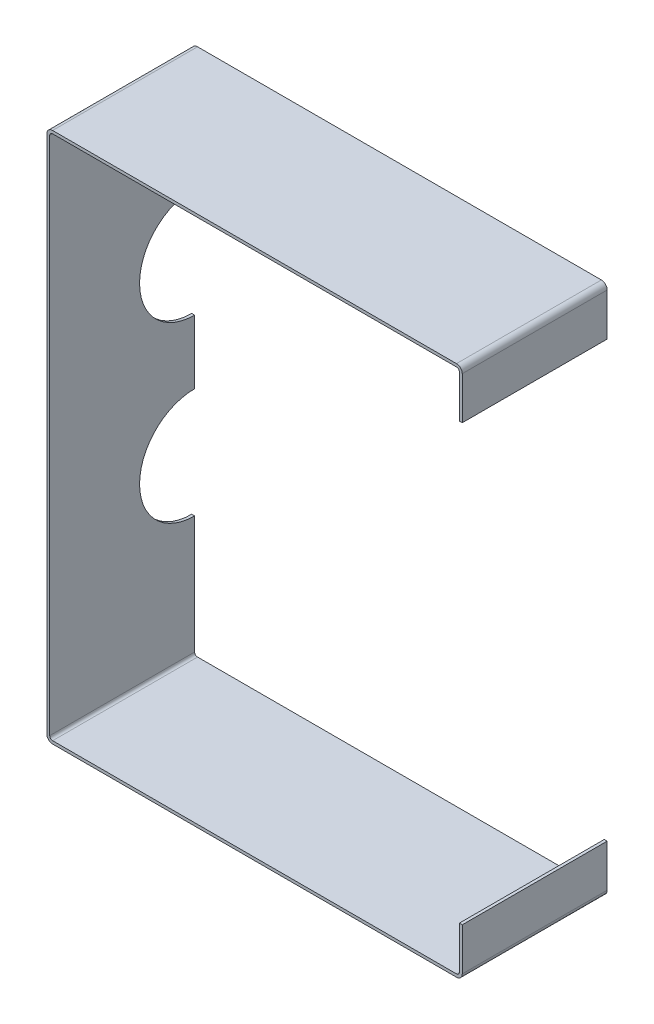
ISO-10303-21;
HEADER;
FILE_DESCRIPTION(('STEP AP214'),'2;1');
FILE_NAME('part.step','',(''),(''),'','','');
FILE_SCHEMA(('AUTOMOTIVE_DESIGN { 1 0 10303 214 1 1 1 1 }'));
ENDSEC;
DATA;
#1=APPLICATION_CONTEXT('core data for automotive mechanical design processes');
#2=APPLICATION_PROTOCOL_DEFINITION('international standard','automotive_design',2000,#1);
#3=PRODUCT_CONTEXT('',#1,'mechanical');
#4=PRODUCT('Part','Part','',(#3));
#5=PRODUCT_RELATED_PRODUCT_CATEGORY('part','',(#4));
#6=PRODUCT_DEFINITION_FORMATION('','',#4);
#7=PRODUCT_DEFINITION_CONTEXT('part definition',#1,'design');
#8=PRODUCT_DEFINITION('design','',#6,#7);
#9=PRODUCT_DEFINITION_SHAPE('','',#8);
#10=(LENGTH_UNIT() NAMED_UNIT(*) SI_UNIT(.MILLI.,.METRE.));
#11=(NAMED_UNIT(*) PLANE_ANGLE_UNIT() SI_UNIT($,.RADIAN.));
#12=(NAMED_UNIT(*) SI_UNIT($,.STERADIAN.) SOLID_ANGLE_UNIT());
#13=UNCERTAINTY_MEASURE_WITH_UNIT(LENGTH_MEASURE(1.E-05),#10,'distance_accuracy_value','');
#14=(GEOMETRIC_REPRESENTATION_CONTEXT(3) GLOBAL_UNCERTAINTY_ASSIGNED_CONTEXT((#13)) GLOBAL_UNIT_ASSIGNED_CONTEXT((#10,
#11,#12)) REPRESENTATION_CONTEXT('',''));
#15=CARTESIAN_POINT('',(0.,0.,0.));
#16=DIRECTION('',(0.,0.,1.));
#17=DIRECTION('',(1.,0.,0.));
#18=AXIS2_PLACEMENT_3D('',#15,#16,#17);
#19=CARTESIAN_POINT('',(424.,269.,-150.));
#20=DIRECTION('',(0.,0.,-1.));
#21=DIRECTION('',(-1.,0.,0.));
#22=AXIS2_PLACEMENT_3D('',#19,#20,#21);
#23=PLANE('',#22);
#24=DIRECTION('',(1.,0.,0.));
#25=VECTOR('',#24,1.);
#26=CARTESIAN_POINT('',(0.,-33.,-150.));
#27=LINE('',#26,#25);
#28=CARTESIAN_POINT('',(0.,-33.,-150.));
#29=VERTEX_POINT('',#28);
#30=CARTESIAN_POINT('',(3.,-33.,-150.));
#31=VERTEX_POINT('',#30);
#32=EDGE_CURVE('E206',#29,#31,#27,.T.);
#33=ORIENTED_EDGE('',*,*,#32,.F.);
#34=DIRECTION('',(0.,-1.,0.));
#35=VECTOR('',#34,1.);
#36=CARTESIAN_POINT('',(0.,-269.,-150.));
#37=LINE('',#36,#35);
#38=CARTESIAN_POINT('',(0.,33.,-150.));
#39=VERTEX_POINT('',#38);
#40=EDGE_CURVE('E215',#39,#29,#37,.T.);
#41=ORIENTED_EDGE('',*,*,#40,.F.);
#42=DIRECTION('',(1.,0.,0.));
#43=VECTOR('',#42,1.);
#44=CARTESIAN_POINT('',(0.,33.,-150.));
#45=LINE('',#44,#43);
#46=CARTESIAN_POINT('',(3.,33.,-150.));
#47=VERTEX_POINT('',#46);
#48=EDGE_CURVE('E398',#39,#47,#45,.T.);
#49=ORIENTED_EDGE('',*,*,#48,.T.);
#50=DIRECTION('',(0.,1.,0.));
#51=VECTOR('',#50,1.);
#52=CARTESIAN_POINT('',(3.,-269.,-150.));
#53=LINE('',#52,#51);
#54=EDGE_CURVE('E61',#31,#47,#53,.T.);
#55=ORIENTED_EDGE('',*,*,#54,.F.);
#56=EDGE_LOOP('',(#33,#41,#49,#55));
#57=FACE_BOUND('',#56,.T.);
#58=ADVANCED_FACE('F37',(#57),#23,.T.);
#59=DIRECTION('',(1.,0.,0.));
#60=VECTOR('',#59,1.);
#61=CARTESIAN_POINT('',(0.,147.,-150.));
#62=LINE('',#61,#60);
#63=CARTESIAN_POINT('',(0.,147.,-150.));
#64=VERTEX_POINT('',#63);
#65=CARTESIAN_POINT('',(3.,147.,-150.));
#66=VERTEX_POINT('',#65);
#67=EDGE_CURVE('E282',#64,#66,#62,.T.);
#68=ORIENTED_EDGE('',*,*,#67,.F.);
#69=CARTESIAN_POINT('',(0.,269.,-150.));
#70=VERTEX_POINT('',#69);
#71=EDGE_CURVE('E224',#70,#64,#37,.T.);
#72=ORIENTED_EDGE('',*,*,#71,.F.);
#73=CARTESIAN_POINT('',(6.,269.,-150.));
#74=DIRECTION('',(0.,0.,1.));
#75=DIRECTION('',(1.,0.,0.));
#76=AXIS2_PLACEMENT_3D('',#73,#74,#75);
#77=CIRCLE('',#76,6.);
#78=CARTESIAN_POINT('',(6.00000000000004,275.,-150.));
#79=VERTEX_POINT('',#78);
#80=EDGE_CURVE('E222',#79,#70,#77,.T.);
#81=ORIENTED_EDGE('',*,*,#80,.F.);
#82=DIRECTION('',(-1.,0.,0.));
#83=VECTOR('',#82,1.);
#84=CARTESIAN_POINT('',(6.00000000000004,275.,-150.));
#85=LINE('',#84,#83);
#86=CARTESIAN_POINT('',(424.,275.,-150.));
#87=VERTEX_POINT('',#86);
#88=EDGE_CURVE('E226',#87,#79,#85,.T.);
#89=ORIENTED_EDGE('',*,*,#88,.F.);
#90=CARTESIAN_POINT('',(424.,269.,-150.));
#91=DIRECTION('',(0.,0.,1.));
#92=DIRECTION('',(-1.,0.,0.));
#93=AXIS2_PLACEMENT_3D('',#90,#91,#92);
#94=CIRCLE('',#93,6.00000000000001);
#95=CARTESIAN_POINT('',(430.,269.,-150.));
#96=VERTEX_POINT('',#95);
#97=EDGE_CURVE('E338',#96,#87,#94,.T.);
#98=ORIENTED_EDGE('',*,*,#97,.F.);
#99=DIRECTION('',(0.,1.,0.));
#100=VECTOR('',#99,1.);
#101=CARTESIAN_POINT('',(430.,269.,-150.));
#102=LINE('',#101,#100);
#103=CARTESIAN_POINT('',(430.,225.,-150.));
#104=VERTEX_POINT('',#103);
#105=EDGE_CURVE('E275',#104,#96,#102,.T.);
#106=ORIENTED_EDGE('',*,*,#105,.F.);
#107=DIRECTION('',(1.,0.,0.));
#108=VECTOR('',#107,1.);
#109=CARTESIAN_POINT('',(427.,225.,-150.));
#110=LINE('',#109,#108);
#111=CARTESIAN_POINT('',(427.,225.,-150.));
#112=VERTEX_POINT('',#111);
#113=EDGE_CURVE('E272',#112,#104,#110,.T.);
#114=ORIENTED_EDGE('',*,*,#113,.F.);
#115=DIRECTION('',(0.,-1.,0.));
#116=VECTOR('',#115,1.);
#117=CARTESIAN_POINT('',(427.,269.,-150.));
#118=LINE('',#117,#116);
#119=CARTESIAN_POINT('',(427.,269.,-150.));
#120=VERTEX_POINT('',#119);
#121=EDGE_CURVE('E269',#120,#112,#118,.T.);
#122=ORIENTED_EDGE('',*,*,#121,.F.);
#123=CARTESIAN_POINT('',(424.,269.,-150.));
#124=DIRECTION('',(0.,0.,-1.));
#125=DIRECTION('',(-1.,0.,0.));
#126=AXIS2_PLACEMENT_3D('',#123,#124,#125);
#127=CIRCLE('',#126,3.);
#128=CARTESIAN_POINT('',(424.,272.,-150.));
#129=VERTEX_POINT('',#128);
#130=EDGE_CURVE('E266',#129,#120,#127,.T.);
#131=ORIENTED_EDGE('',*,*,#130,.F.);
#132=DIRECTION('',(1.,0.,0.));
#133=VECTOR('',#132,1.);
#134=CARTESIAN_POINT('',(6.00000000000002,272.,-150.));
#135=LINE('',#134,#133);
#136=CARTESIAN_POINT('',(6.00000000000002,272.,-150.));
#137=VERTEX_POINT('',#136);
#138=EDGE_CURVE('E263',#137,#129,#135,.T.);
#139=ORIENTED_EDGE('',*,*,#138,.F.);
#140=CARTESIAN_POINT('',(6.,269.,-150.));
#141=DIRECTION('',(0.,0.,-1.));
#142=DIRECTION('',(1.,0.,0.));
#143=AXIS2_PLACEMENT_3D('',#140,#141,#142);
#144=CIRCLE('',#143,3.);
#145=CARTESIAN_POINT('',(3.,269.,-150.));
#146=VERTEX_POINT('',#145);
#147=EDGE_CURVE('E260',#146,#137,#144,.T.);
#148=ORIENTED_EDGE('',*,*,#147,.F.);
#149=EDGE_CURVE('E257',#66,#146,#53,.T.);
#150=ORIENTED_EDGE('',*,*,#149,.F.);
#151=EDGE_LOOP('',(#68,#72,#81,#89,#98,#106,#114,#122,#131,#139,#148,#150));
#152=FACE_BOUND('',#151,.T.);
#153=ADVANCED_FACE('F392',(#152),#23,.T.);
#154=CARTESIAN_POINT('',(424.,269.,-150.));
#155=DIRECTION('',(0.,0.,1.));
#156=DIRECTION('',(1.,0.,0.));
#157=AXIS2_PLACEMENT_3D('',#154,#155,#156);
#158=CYLINDRICAL_SURFACE('',#157,6.00000000000001);
#159=CARTESIAN_POINT('',(424.,269.,0.));
#160=DIRECTION('',(0.,0.,1.));
#161=DIRECTION('',(-1.,0.,0.));
#162=AXIS2_PLACEMENT_3D('',#159,#160,#161);
#163=CIRCLE('',#162,6.00000000000001);
#164=CARTESIAN_POINT('',(430.,269.,0.));
#165=VERTEX_POINT('',#164);
#166=CARTESIAN_POINT('',(424.,275.,0.));
#167=VERTEX_POINT('',#166);
#168=EDGE_CURVE('E278',#165,#167,#163,.T.);
#169=ORIENTED_EDGE('',*,*,#168,.F.);
#170=DIRECTION('',(0.,0.,1.));
#171=VECTOR('',#170,1.);
#172=CARTESIAN_POINT('',(430.,269.,-150.));
#173=LINE('',#172,#171);
#174=EDGE_CURVE('E11',#96,#165,#173,.T.);
#175=ORIENTED_EDGE('',*,*,#174,.F.);
#176=ORIENTED_EDGE('',*,*,#97,.T.);
#177=DIRECTION('',(0.,0.,1.));
#178=VECTOR('',#177,1.);
#179=CARTESIAN_POINT('',(424.,275.,-150.));
#180=LINE('',#179,#178);
#181=EDGE_CURVE('E41',#87,#167,#180,.T.);
#182=ORIENTED_EDGE('',*,*,#181,.T.);
#183=EDGE_LOOP('',(#169,#175,#176,#182));
#184=FACE_BOUND('',#183,.T.);
#185=ADVANCED_FACE('F39',(#184),#158,.T.);
#186=CARTESIAN_POINT('',(430.,269.,-150.));
#187=DIRECTION('',(1.,0.,0.));
#188=DIRECTION('',(0.,1.,0.));
#189=AXIS2_PLACEMENT_3D('',#186,#187,#188);
#190=PLANE('',#189);
#191=DIRECTION('',(0.,1.,0.));
#192=VECTOR('',#191,1.);
#193=CARTESIAN_POINT('',(430.,269.,0.));
#194=LINE('',#193,#192);
#195=CARTESIAN_POINT('',(430.,225.,0.));
#196=VERTEX_POINT('',#195);
#197=EDGE_CURVE('E336',#196,#165,#194,.T.);
#198=ORIENTED_EDGE('',*,*,#197,.F.);
#199=DIRECTION('',(0.,0.,1.));
#200=VECTOR('',#199,1.);
#201=CARTESIAN_POINT('',(430.,225.,-150.));
#202=LINE('',#201,#200);
#203=EDGE_CURVE('E46',#104,#196,#202,.T.);
#204=ORIENTED_EDGE('',*,*,#203,.F.);
#205=ORIENTED_EDGE('',*,*,#105,.T.);
#206=ORIENTED_EDGE('',*,*,#174,.T.);
#207=EDGE_LOOP('',(#198,#204,#205,#206));
#208=FACE_BOUND('',#207,.T.);
#209=ADVANCED_FACE('F388',(#208),#190,.T.);
#210=CARTESIAN_POINT('',(427.,225.,-150.));
#211=DIRECTION('',(0.,-1.,0.));
#212=DIRECTION('',(0.,0.,-1.));
#213=AXIS2_PLACEMENT_3D('',#210,#211,#212);
#214=PLANE('',#213);
#215=DIRECTION('',(1.,0.,0.));
#216=VECTOR('',#215,1.);
#217=CARTESIAN_POINT('',(427.,225.,0.));
#218=LINE('',#217,#216);
#219=CARTESIAN_POINT('',(427.,225.,0.));
#220=VERTEX_POINT('',#219);
#221=EDGE_CURVE('E333',#220,#196,#218,.T.);
#222=ORIENTED_EDGE('',*,*,#221,.F.);
#223=DIRECTION('',(0.,0.,1.));
#224=VECTOR('',#223,1.);
#225=CARTESIAN_POINT('',(427.,225.,-150.));
#226=LINE('',#225,#224);
#227=EDGE_CURVE('E341',#112,#220,#226,.T.);
#228=ORIENTED_EDGE('',*,*,#227,.F.);
#229=ORIENTED_EDGE('',*,*,#113,.T.);
#230=ORIENTED_EDGE('',*,*,#203,.T.);
#231=EDGE_LOOP('',(#222,#228,#229,#230));
#232=FACE_BOUND('',#231,.T.);
#233=ADVANCED_FACE('F485',(#232),#214,.T.);
#234=CARTESIAN_POINT('',(427.,269.,-150.));
#235=DIRECTION('',(-1.,0.,0.));
#236=DIRECTION('',(0.,0.,1.));
#237=AXIS2_PLACEMENT_3D('',#234,#235,#236);
#238=PLANE('',#237);
#239=DIRECTION('',(0.,-1.,0.));
#240=VECTOR('',#239,1.);
#241=CARTESIAN_POINT('',(427.,269.,0.));
#242=LINE('',#241,#240);
#243=CARTESIAN_POINT('',(427.,269.,0.));
#244=VERTEX_POINT('',#243);
#245=EDGE_CURVE('E330',#244,#220,#242,.T.);
#246=ORIENTED_EDGE('',*,*,#245,.F.);
#247=DIRECTION('',(0.,0.,1.));
#248=VECTOR('',#247,1.);
#249=CARTESIAN_POINT('',(427.,269.,-150.));
#250=LINE('',#249,#248);
#251=EDGE_CURVE('E343',#120,#244,#250,.T.);
#252=ORIENTED_EDGE('',*,*,#251,.F.);
#253=ORIENTED_EDGE('',*,*,#121,.T.);
#254=ORIENTED_EDGE('',*,*,#227,.T.);
#255=EDGE_LOOP('',(#246,#252,#253,#254));
#256=FACE_BOUND('',#255,.T.);
#257=ADVANCED_FACE('F488',(#256),#238,.T.);
#258=CARTESIAN_POINT('',(424.,269.,-150.));
#259=DIRECTION('',(0.,0.,1.));
#260=DIRECTION('',(1.,0.,0.));
#261=AXIS2_PLACEMENT_3D('',#258,#259,#260);
#262=CYLINDRICAL_SURFACE('',#261,3.);
#263=CARTESIAN_POINT('',(424.,269.,0.));
#264=DIRECTION('',(0.,0.,-1.));
#265=DIRECTION('',(-1.,0.,0.));
#266=AXIS2_PLACEMENT_3D('',#263,#264,#265);
#267=CIRCLE('',#266,3.);
#268=CARTESIAN_POINT('',(424.,272.,0.));
#269=VERTEX_POINT('',#268);
#270=EDGE_CURVE('E327',#269,#244,#267,.T.);
#271=ORIENTED_EDGE('',*,*,#270,.F.);
#272=DIRECTION('',(0.,0.,1.));
#273=VECTOR('',#272,1.);
#274=CARTESIAN_POINT('',(424.,272.,-150.));
#275=LINE('',#274,#273);
#276=EDGE_CURVE('E345',#129,#269,#275,.T.);
#277=ORIENTED_EDGE('',*,*,#276,.F.);
#278=ORIENTED_EDGE('',*,*,#130,.T.);
#279=ORIENTED_EDGE('',*,*,#251,.T.);
#280=EDGE_LOOP('',(#271,#277,#278,#279));
#281=FACE_BOUND('',#280,.T.);
#282=ADVANCED_FACE('F492',(#281),#262,.F.);
#283=CARTESIAN_POINT('',(6.00000000000002,272.,-150.));
#284=DIRECTION('',(0.,-1.,0.));
#285=DIRECTION('',(0.,0.,-1.));
#286=AXIS2_PLACEMENT_3D('',#283,#284,#285);
#287=PLANE('',#286);
#288=DIRECTION('',(1.,0.,0.));
#289=VECTOR('',#288,1.);
#290=CARTESIAN_POINT('',(6.00000000000002,272.,0.));
#291=LINE('',#290,#289);
#292=CARTESIAN_POINT('',(6.00000000000002,272.,0.));
#293=VERTEX_POINT('',#292);
#294=EDGE_CURVE('E324',#293,#269,#291,.T.);
#295=ORIENTED_EDGE('',*,*,#294,.F.);
#296=DIRECTION('',(0.,0.,1.));
#297=VECTOR('',#296,1.);
#298=CARTESIAN_POINT('',(6.00000000000002,272.,-150.));
#299=LINE('',#298,#297);
#300=EDGE_CURVE('E347',#137,#293,#299,.T.);
#301=ORIENTED_EDGE('',*,*,#300,.F.);
#302=ORIENTED_EDGE('',*,*,#138,.T.);
#303=ORIENTED_EDGE('',*,*,#276,.T.);
#304=EDGE_LOOP('',(#295,#301,#302,#303));
#305=FACE_BOUND('',#304,.T.);
#306=ADVANCED_FACE('F421',(#305),#287,.T.);
#307=CARTESIAN_POINT('',(6.,269.,-150.));
#308=DIRECTION('',(0.,0.,1.));
#309=DIRECTION('',(1.,0.,0.));
#310=AXIS2_PLACEMENT_3D('',#307,#308,#309);
#311=CYLINDRICAL_SURFACE('',#310,3.);
#312=CARTESIAN_POINT('',(6.,269.,0.));
#313=DIRECTION('',(0.,0.,-1.));
#314=DIRECTION('',(1.,0.,0.));
#315=AXIS2_PLACEMENT_3D('',#312,#313,#314);
#316=CIRCLE('',#315,3.);
#317=CARTESIAN_POINT('',(3.,269.,0.));
#318=VERTEX_POINT('',#317);
#319=EDGE_CURVE('E321',#318,#293,#316,.T.);
#320=ORIENTED_EDGE('',*,*,#319,.F.);
#321=DIRECTION('',(0.,0.,1.));
#322=VECTOR('',#321,1.);
#323=CARTESIAN_POINT('',(3.,269.,-150.));
#324=LINE('',#323,#322);
#325=EDGE_CURVE('E349',#146,#318,#324,.T.);
#326=ORIENTED_EDGE('',*,*,#325,.F.);
#327=ORIENTED_EDGE('',*,*,#147,.T.);
#328=ORIENTED_EDGE('',*,*,#300,.T.);
#329=EDGE_LOOP('',(#320,#326,#327,#328));
#330=FACE_BOUND('',#329,.T.);
#331=ADVANCED_FACE('F415',(#330),#311,.F.);
#332=CARTESIAN_POINT('',(3.,-269.,-150.));
#333=DIRECTION('',(1.,0.,0.));
#334=DIRECTION('',(0.,1.,0.));
#335=AXIS2_PLACEMENT_3D('',#332,#333,#334);
#336=PLANE('',#335);
#337=CARTESIAN_POINT('',(3.,-90.,-150.));
#338=DIRECTION('',(1.,0.,0.));
#339=DIRECTION('',(0.,-1.,0.));
#340=AXIS2_PLACEMENT_3D('',#337,#338,#339);
#341=CIRCLE('',#340,57.);
#342=CARTESIAN_POINT('',(3.,-147.,-150.));
#343=VERTEX_POINT('',#342);
#344=EDGE_CURVE('E54',#31,#343,#341,.T.);
#345=ORIENTED_EDGE('',*,*,#344,.F.);
#346=ORIENTED_EDGE('',*,*,#54,.T.);
#347=CARTESIAN_POINT('',(3.,90.,-150.));
#348=DIRECTION('',(1.,0.,0.));
#349=DIRECTION('',(0.,1.,0.));
#350=AXIS2_PLACEMENT_3D('',#347,#348,#349);
#351=CIRCLE('',#350,57.);
#352=EDGE_CURVE('E403',#66,#47,#351,.T.);
#353=ORIENTED_EDGE('',*,*,#352,.F.);
#354=ORIENTED_EDGE('',*,*,#149,.T.);
#355=ORIENTED_EDGE('',*,*,#325,.T.);
#356=DIRECTION('',(0.,1.,0.));
#357=VECTOR('',#356,1.);
#358=CARTESIAN_POINT('',(3.,-269.,0.));
#359=LINE('',#358,#357);
#360=CARTESIAN_POINT('',(3.,-269.,0.));
#361=VERTEX_POINT('',#360);
#362=EDGE_CURVE('E318',#361,#318,#359,.T.);
#363=ORIENTED_EDGE('',*,*,#362,.F.);
#364=DIRECTION('',(0.,0.,1.));
#365=VECTOR('',#364,1.);
#366=CARTESIAN_POINT('',(3.,-269.,-150.));
#367=LINE('',#366,#365);
#368=CARTESIAN_POINT('',(3.,-269.,-150.));
#369=VERTEX_POINT('',#368);
#370=EDGE_CURVE('E351',#369,#361,#367,.T.);
#371=ORIENTED_EDGE('',*,*,#370,.F.);
#372=EDGE_CURVE('E258',#369,#343,#53,.T.);
#373=ORIENTED_EDGE('',*,*,#372,.T.);
#374=EDGE_LOOP('',(#345,#346,#353,#354,#355,#363,#371,#373));
#375=FACE_BOUND('',#374,.T.);
#376=ADVANCED_FACE('F408',(#375),#336,.T.);
#377=CARTESIAN_POINT('',(6.,-269.,-150.));
#378=DIRECTION('',(0.,0.,1.));
#379=DIRECTION('',(1.,0.,0.));
#380=AXIS2_PLACEMENT_3D('',#377,#378,#379);
#381=CYLINDRICAL_SURFACE('',#380,3.);
#382=CARTESIAN_POINT('',(6.,-269.,0.));
#383=DIRECTION('',(0.,0.,-1.));
#384=DIRECTION('',(-1.,0.,0.));
#385=AXIS2_PLACEMENT_3D('',#382,#383,#384);
#386=CIRCLE('',#385,3.);
#387=CARTESIAN_POINT('',(6.00000000000004,-272.,0.));
#388=VERTEX_POINT('',#387);
#389=EDGE_CURVE('E315',#388,#361,#386,.T.);
#390=ORIENTED_EDGE('',*,*,#389,.F.);
#391=DIRECTION('',(0.,0.,1.));
#392=VECTOR('',#391,1.);
#393=CARTESIAN_POINT('',(6.00000000000004,-272.,-150.));
#394=LINE('',#393,#392);
#395=CARTESIAN_POINT('',(6.00000000000004,-272.,-150.));
#396=VERTEX_POINT('',#395);
#397=EDGE_CURVE('E353',#396,#388,#394,.T.);
#398=ORIENTED_EDGE('',*,*,#397,.F.);
#399=CARTESIAN_POINT('',(6.,-269.,-150.));
#400=DIRECTION('',(0.,0.,-1.));
#401=DIRECTION('',(-1.,0.,0.));
#402=AXIS2_PLACEMENT_3D('',#399,#400,#401);
#403=CIRCLE('',#402,3.);
#404=EDGE_CURVE('E254',#396,#369,#403,.T.);
#405=ORIENTED_EDGE('',*,*,#404,.T.);
#406=ORIENTED_EDGE('',*,*,#370,.T.);
#407=EDGE_LOOP('',(#390,#398,#405,#406));
#408=FACE_BOUND('',#407,.T.);
#409=ADVANCED_FACE('F427',(#408),#381,.F.);
#410=CARTESIAN_POINT('',(6.00000000000004,-272.,-150.));
#411=DIRECTION('',(0.,1.,0.));
#412=DIRECTION('',(0.,0.,1.));
#413=AXIS2_PLACEMENT_3D('',#410,#411,#412);
#414=PLANE('',#413);
#415=DIRECTION('',(-1.,0.,0.));
#416=VECTOR('',#415,1.);
#417=CARTESIAN_POINT('',(6.00000000000004,-272.,0.));
#418=LINE('',#417,#416);
#419=CARTESIAN_POINT('',(424.,-272.,0.));
#420=VERTEX_POINT('',#419);
#421=EDGE_CURVE('E312',#420,#388,#418,.T.);
#422=ORIENTED_EDGE('',*,*,#421,.F.);
#423=DIRECTION('',(0.,0.,1.));
#424=VECTOR('',#423,1.);
#425=CARTESIAN_POINT('',(424.,-272.,-150.));
#426=LINE('',#425,#424);
#427=CARTESIAN_POINT('',(424.,-272.,-150.));
#428=VERTEX_POINT('',#427);
#429=EDGE_CURVE('E355',#428,#420,#426,.T.);
#430=ORIENTED_EDGE('',*,*,#429,.F.);
#431=DIRECTION('',(-1.,0.,0.));
#432=VECTOR('',#431,1.);
#433=CARTESIAN_POINT('',(6.00000000000004,-272.,-150.));
#434=LINE('',#433,#432);
#435=EDGE_CURVE('E251',#428,#396,#434,.T.);
#436=ORIENTED_EDGE('',*,*,#435,.T.);
#437=ORIENTED_EDGE('',*,*,#397,.T.);
#438=EDGE_LOOP('',(#422,#430,#436,#437));
#439=FACE_BOUND('',#438,.T.);
#440=ADVANCED_FACE('F430',(#439),#414,.T.);
#441=CARTESIAN_POINT('',(424.,-269.,-150.));
#442=DIRECTION('',(0.,0.,1.));
#443=DIRECTION('',(1.,0.,0.));
#444=AXIS2_PLACEMENT_3D('',#441,#442,#443);
#445=CYLINDRICAL_SURFACE('',#444,3.);
#446=CARTESIAN_POINT('',(424.,-269.,0.));
#447=DIRECTION('',(0.,0.,-1.));
#448=DIRECTION('',(1.,0.,0.));
#449=AXIS2_PLACEMENT_3D('',#446,#447,#448);
#450=CIRCLE('',#449,3.);
#451=CARTESIAN_POINT('',(427.,-269.,0.));
#452=VERTEX_POINT('',#451);
#453=EDGE_CURVE('E309',#452,#420,#450,.T.);
#454=ORIENTED_EDGE('',*,*,#453,.F.);
#455=DIRECTION('',(0.,0.,1.));
#456=VECTOR('',#455,1.);
#457=CARTESIAN_POINT('',(427.,-269.,-150.));
#458=LINE('',#457,#456);
#459=CARTESIAN_POINT('',(427.,-269.,-150.));
#460=VERTEX_POINT('',#459);
#461=EDGE_CURVE('E357',#460,#452,#458,.T.);
#462=ORIENTED_EDGE('',*,*,#461,.F.);
#463=CARTESIAN_POINT('',(424.,-269.,-150.));
#464=DIRECTION('',(0.,0.,-1.));
#465=DIRECTION('',(1.,0.,0.));
#466=AXIS2_PLACEMENT_3D('',#463,#464,#465);
#467=CIRCLE('',#466,3.);
#468=EDGE_CURVE('E248',#460,#428,#467,.T.);
#469=ORIENTED_EDGE('',*,*,#468,.T.);
#470=ORIENTED_EDGE('',*,*,#429,.T.);
#471=EDGE_LOOP('',(#454,#462,#469,#470));
#472=FACE_BOUND('',#471,.T.);
#473=ADVANCED_FACE('F435',(#472),#445,.F.);
#474=CARTESIAN_POINT('',(427.,-269.,-150.));
#475=DIRECTION('',(-1.,0.,0.));
#476=DIRECTION('',(0.,0.,1.));
#477=AXIS2_PLACEMENT_3D('',#474,#475,#476);
#478=PLANE('',#477);
#479=DIRECTION('',(0.,-1.,0.));
#480=VECTOR('',#479,1.);
#481=CARTESIAN_POINT('',(427.,-269.,0.));
#482=LINE('',#481,#480);
#483=CARTESIAN_POINT('',(427.,-225.,0.));
#484=VERTEX_POINT('',#483);
#485=EDGE_CURVE('E306',#484,#452,#482,.T.);
#486=ORIENTED_EDGE('',*,*,#485,.F.);
#487=DIRECTION('',(0.,0.,1.));
#488=VECTOR('',#487,1.);
#489=CARTESIAN_POINT('',(427.,-225.,-150.));
#490=LINE('',#489,#488);
#491=CARTESIAN_POINT('',(427.,-225.,-150.));
#492=VERTEX_POINT('',#491);
#493=EDGE_CURVE('E359',#492,#484,#490,.T.);
#494=ORIENTED_EDGE('',*,*,#493,.F.);
#495=DIRECTION('',(0.,-1.,0.));
#496=VECTOR('',#495,1.);
#497=CARTESIAN_POINT('',(427.,-269.,-150.));
#498=LINE('',#497,#496);
#499=EDGE_CURVE('E245',#492,#460,#498,.T.);
#500=ORIENTED_EDGE('',*,*,#499,.T.);
#501=ORIENTED_EDGE('',*,*,#461,.T.);
#502=EDGE_LOOP('',(#486,#494,#500,#501));
#503=FACE_BOUND('',#502,.T.);
#504=ADVANCED_FACE('F438',(#503),#478,.T.);
#505=CARTESIAN_POINT('',(427.,-225.,-150.));
#506=DIRECTION('',(0.,1.,0.));
#507=DIRECTION('',(0.,0.,1.));
#508=AXIS2_PLACEMENT_3D('',#505,#506,#507);
#509=PLANE('',#508);
#510=DIRECTION('',(-1.,0.,0.));
#511=VECTOR('',#510,1.);
#512=CARTESIAN_POINT('',(427.,-225.,0.));
#513=LINE('',#512,#511);
#514=CARTESIAN_POINT('',(430.,-225.,0.));
#515=VERTEX_POINT('',#514);
#516=EDGE_CURVE('E303',#515,#484,#513,.T.);
#517=ORIENTED_EDGE('',*,*,#516,.F.);
#518=DIRECTION('',(0.,0.,1.));
#519=VECTOR('',#518,1.);
#520=CARTESIAN_POINT('',(430.,-225.,-150.));
#521=LINE('',#520,#519);
#522=CARTESIAN_POINT('',(430.,-225.,-150.));
#523=VERTEX_POINT('',#522);
#524=EDGE_CURVE('E361',#523,#515,#521,.T.);
#525=ORIENTED_EDGE('',*,*,#524,.F.);
#526=DIRECTION('',(-1.,0.,0.));
#527=VECTOR('',#526,1.);
#528=CARTESIAN_POINT('',(427.,-225.,-150.));
#529=LINE('',#528,#527);
#530=EDGE_CURVE('E242',#523,#492,#529,.T.);
#531=ORIENTED_EDGE('',*,*,#530,.T.);
#532=ORIENTED_EDGE('',*,*,#493,.T.);
#533=EDGE_LOOP('',(#517,#525,#531,#532));
#534=FACE_BOUND('',#533,.T.);
#535=ADVANCED_FACE('F443',(#534),#509,.T.);
#536=CARTESIAN_POINT('',(430.,-269.,-150.));
#537=DIRECTION('',(1.,0.,0.));
#538=DIRECTION('',(0.,1.,0.));
#539=AXIS2_PLACEMENT_3D('',#536,#537,#538);
#540=PLANE('',#539);
#541=DIRECTION('',(0.,1.,0.));
#542=VECTOR('',#541,1.);
#543=CARTESIAN_POINT('',(430.,-269.,0.));
#544=LINE('',#543,#542);
#545=CARTESIAN_POINT('',(430.,-269.,0.));
#546=VERTEX_POINT('',#545);
#547=EDGE_CURVE('E300',#546,#515,#544,.T.);
#548=ORIENTED_EDGE('',*,*,#547,.F.);
#549=DIRECTION('',(0.,0.,1.));
#550=VECTOR('',#549,1.);
#551=CARTESIAN_POINT('',(430.,-269.,-150.));
#552=LINE('',#551,#550);
#553=CARTESIAN_POINT('',(430.,-269.,-150.));
#554=VERTEX_POINT('',#553);
#555=EDGE_CURVE('E363',#554,#546,#552,.T.);
#556=ORIENTED_EDGE('',*,*,#555,.F.);
#557=DIRECTION('',(0.,1.,0.));
#558=VECTOR('',#557,1.);
#559=CARTESIAN_POINT('',(430.,-269.,-150.));
#560=LINE('',#559,#558);
#561=EDGE_CURVE('E239',#554,#523,#560,.T.);
#562=ORIENTED_EDGE('',*,*,#561,.T.);
#563=ORIENTED_EDGE('',*,*,#524,.T.);
#564=EDGE_LOOP('',(#548,#556,#562,#563));
#565=FACE_BOUND('',#564,.T.);
#566=ADVANCED_FACE('F446',(#565),#540,.T.);
#567=CARTESIAN_POINT('',(424.,-269.,-150.));
#568=DIRECTION('',(0.,0.,1.));
#569=DIRECTION('',(1.,0.,0.));
#570=AXIS2_PLACEMENT_3D('',#567,#568,#569);
#571=CYLINDRICAL_SURFACE('',#570,6.00000000000001);
#572=CARTESIAN_POINT('',(424.,-269.,0.));
#573=DIRECTION('',(0.,0.,1.));
#574=DIRECTION('',(1.,0.,0.));
#575=AXIS2_PLACEMENT_3D('',#572,#573,#574);
#576=CIRCLE('',#575,6.00000000000001);
#577=CARTESIAN_POINT('',(424.,-275.,0.));
#578=VERTEX_POINT('',#577);
#579=EDGE_CURVE('E297',#578,#546,#576,.T.);
#580=ORIENTED_EDGE('',*,*,#579,.F.);
#581=DIRECTION('',(0.,0.,1.));
#582=VECTOR('',#581,1.);
#583=CARTESIAN_POINT('',(424.,-275.,-150.));
#584=LINE('',#583,#582);
#585=CARTESIAN_POINT('',(424.,-275.,-150.));
#586=VERTEX_POINT('',#585);
#587=EDGE_CURVE('E365',#586,#578,#584,.T.);
#588=ORIENTED_EDGE('',*,*,#587,.F.);
#589=CARTESIAN_POINT('',(424.,-269.,-150.));
#590=DIRECTION('',(0.,0.,1.));
#591=DIRECTION('',(1.,0.,0.));
#592=AXIS2_PLACEMENT_3D('',#589,#590,#591);
#593=CIRCLE('',#592,6.00000000000001);
#594=EDGE_CURVE('E234',#586,#554,#593,.T.);
#595=ORIENTED_EDGE('',*,*,#594,.T.);
#596=ORIENTED_EDGE('',*,*,#555,.T.);
#597=EDGE_LOOP('',(#580,#588,#595,#596));
#598=FACE_BOUND('',#597,.T.);
#599=ADVANCED_FACE('F450',(#598),#571,.T.);
#600=CARTESIAN_POINT('',(6.00000000000004,-275.,-150.));
#601=DIRECTION('',(0.,-1.,0.));
#602=DIRECTION('',(0.,0.,-1.));
#603=AXIS2_PLACEMENT_3D('',#600,#601,#602);
#604=PLANE('',#603);
#605=DIRECTION('',(1.,0.,0.));
#606=VECTOR('',#605,1.);
#607=CARTESIAN_POINT('',(6.00000000000004,-275.,0.));
#608=LINE('',#607,#606);
#609=CARTESIAN_POINT('',(6.00000000000004,-275.,0.));
#610=VERTEX_POINT('',#609);
#611=EDGE_CURVE('E294',#610,#578,#608,.T.);
#612=ORIENTED_EDGE('',*,*,#611,.F.);
#613=DIRECTION('',(0.,0.,1.));
#614=VECTOR('',#613,1.);
#615=CARTESIAN_POINT('',(6.00000000000004,-275.,-150.));
#616=LINE('',#615,#614);
#617=CARTESIAN_POINT('',(6.00000000000004,-275.,-150.));
#618=VERTEX_POINT('',#617);
#619=EDGE_CURVE('E367',#618,#610,#616,.T.);
#620=ORIENTED_EDGE('',*,*,#619,.F.);
#621=DIRECTION('',(1.,0.,0.));
#622=VECTOR('',#621,1.);
#623=CARTESIAN_POINT('',(6.00000000000004,-275.,-150.));
#624=LINE('',#623,#622);
#625=EDGE_CURVE('E231',#618,#586,#624,.T.);
#626=ORIENTED_EDGE('',*,*,#625,.T.);
#627=ORIENTED_EDGE('',*,*,#587,.T.);
#628=EDGE_LOOP('',(#612,#620,#626,#627));
#629=FACE_BOUND('',#628,.T.);
#630=ADVANCED_FACE('F453',(#629),#604,.T.);
#631=CARTESIAN_POINT('',(6.,-269.,-150.));
#632=DIRECTION('',(0.,0.,1.));
#633=DIRECTION('',(1.,0.,0.));
#634=AXIS2_PLACEMENT_3D('',#631,#632,#633);
#635=CYLINDRICAL_SURFACE('',#634,6.);
#636=CARTESIAN_POINT('',(6.,-269.,0.));
#637=DIRECTION('',(0.,0.,1.));
#638=DIRECTION('',(-1.,0.,0.));
#639=AXIS2_PLACEMENT_3D('',#636,#637,#638);
#640=CIRCLE('',#639,6.);
#641=CARTESIAN_POINT('',(0.,-269.,0.));
#642=VERTEX_POINT('',#641);
#643=EDGE_CURVE('E291',#642,#610,#640,.T.);
#644=ORIENTED_EDGE('',*,*,#643,.F.);
#645=DIRECTION('',(0.,0.,1.));
#646=VECTOR('',#645,1.);
#647=CARTESIAN_POINT('',(0.,-269.,-150.));
#648=LINE('',#647,#646);
#649=CARTESIAN_POINT('',(0.,-269.,-150.));
#650=VERTEX_POINT('',#649);
#651=EDGE_CURVE('E369',#650,#642,#648,.T.);
#652=ORIENTED_EDGE('',*,*,#651,.F.);
#653=CARTESIAN_POINT('',(6.,-269.,-150.));
#654=DIRECTION('',(0.,0.,1.));
#655=DIRECTION('',(-1.,0.,0.));
#656=AXIS2_PLACEMENT_3D('',#653,#654,#655);
#657=CIRCLE('',#656,6.);
#658=EDGE_CURVE('E221',#650,#618,#657,.T.);
#659=ORIENTED_EDGE('',*,*,#658,.T.);
#660=ORIENTED_EDGE('',*,*,#619,.T.);
#661=EDGE_LOOP('',(#644,#652,#659,#660));
#662=FACE_BOUND('',#661,.T.);
#663=ADVANCED_FACE('F455',(#662),#635,.T.);
#664=CARTESIAN_POINT('',(0.,-269.,-150.));
#665=DIRECTION('',(-1.,0.,0.));
#666=DIRECTION('',(0.,0.,1.));
#667=AXIS2_PLACEMENT_3D('',#664,#665,#666);
#668=PLANE('',#667);
#669=CARTESIAN_POINT('',(0.,-90.,-150.));
#670=DIRECTION('',(1.,0.,0.));
#671=DIRECTION('',(0.,-1.,0.));
#672=AXIS2_PLACEMENT_3D('',#669,#670,#671);
#673=CIRCLE('',#672,57.);
#674=CARTESIAN_POINT('',(0.,-147.,-150.));
#675=VERTEX_POINT('',#674);
#676=EDGE_CURVE('E200',#29,#675,#673,.T.);
#677=ORIENTED_EDGE('',*,*,#676,.T.);
#678=EDGE_CURVE('E211',#675,#650,#37,.T.);
#679=ORIENTED_EDGE('',*,*,#678,.T.);
#680=ORIENTED_EDGE('',*,*,#651,.T.);
#681=DIRECTION('',(0.,-1.,0.));
#682=VECTOR('',#681,1.);
#683=CARTESIAN_POINT('',(0.,-269.,0.));
#684=LINE('',#683,#682);
#685=CARTESIAN_POINT('',(0.,269.,0.));
#686=VERTEX_POINT('',#685);
#687=EDGE_CURVE('E288',#686,#642,#684,.T.);
#688=ORIENTED_EDGE('',*,*,#687,.F.);
#689=DIRECTION('',(0.,0.,1.));
#690=VECTOR('',#689,1.);
#691=CARTESIAN_POINT('',(0.,269.,-150.));
#692=LINE('',#691,#690);
#693=EDGE_CURVE('E371',#70,#686,#692,.T.);
#694=ORIENTED_EDGE('',*,*,#693,.F.);
#695=ORIENTED_EDGE('',*,*,#71,.T.);
#696=CARTESIAN_POINT('',(0.,90.,-150.));
#697=DIRECTION('',(1.,0.,0.));
#698=DIRECTION('',(0.,1.,0.));
#699=AXIS2_PLACEMENT_3D('',#696,#697,#698);
#700=CIRCLE('',#699,57.);
#701=EDGE_CURVE('E401',#64,#39,#700,.T.);
#702=ORIENTED_EDGE('',*,*,#701,.T.);
#703=ORIENTED_EDGE('',*,*,#40,.T.);
#704=EDGE_LOOP('',(#677,#679,#680,#688,#694,#695,#702,#703));
#705=FACE_BOUND('',#704,.T.);
#706=ADVANCED_FACE('F210',(#705),#668,.T.);
#707=CARTESIAN_POINT('',(6.,269.,-150.));
#708=DIRECTION('',(0.,0.,1.));
#709=DIRECTION('',(1.,0.,0.));
#710=AXIS2_PLACEMENT_3D('',#707,#708,#709);
#711=CYLINDRICAL_SURFACE('',#710,6.);
#712=CARTESIAN_POINT('',(6.,269.,0.));
#713=DIRECTION('',(0.,0.,1.));
#714=DIRECTION('',(1.,0.,0.));
#715=AXIS2_PLACEMENT_3D('',#712,#713,#714);
#716=CIRCLE('',#715,6.);
#717=CARTESIAN_POINT('',(6.00000000000004,275.,0.));
#718=VERTEX_POINT('',#717);
#719=EDGE_CURVE('E285',#718,#686,#716,.T.);
#720=ORIENTED_EDGE('',*,*,#719,.F.);
#721=DIRECTION('',(0.,0.,1.));
#722=VECTOR('',#721,1.);
#723=CARTESIAN_POINT('',(6.00000000000004,275.,-150.));
#724=LINE('',#723,#722);
#725=EDGE_CURVE('E372',#79,#718,#724,.T.);
#726=ORIENTED_EDGE('',*,*,#725,.F.);
#727=ORIENTED_EDGE('',*,*,#80,.T.);
#728=ORIENTED_EDGE('',*,*,#693,.T.);
#729=EDGE_LOOP('',(#720,#726,#727,#728));
#730=FACE_BOUND('',#729,.T.);
#731=ADVANCED_FACE('F458',(#730),#711,.T.);
#732=CARTESIAN_POINT('',(6.00000000000004,275.,-150.));
#733=DIRECTION('',(0.,1.,0.));
#734=DIRECTION('',(0.,0.,1.));
#735=AXIS2_PLACEMENT_3D('',#732,#733,#734);
#736=PLANE('',#735);
#737=DIRECTION('',(-1.,0.,0.));
#738=VECTOR('',#737,1.);
#739=CARTESIAN_POINT('',(6.00000000000004,275.,0.));
#740=LINE('',#739,#738);
#741=EDGE_CURVE('E281',#167,#718,#740,.T.);
#742=ORIENTED_EDGE('',*,*,#741,.F.);
#743=ORIENTED_EDGE('',*,*,#181,.F.);
#744=ORIENTED_EDGE('',*,*,#88,.T.);
#745=ORIENTED_EDGE('',*,*,#725,.T.);
#746=EDGE_LOOP('',(#742,#743,#744,#745));
#747=FACE_BOUND('',#746,.T.);
#748=ADVANCED_FACE('F382',(#747),#736,.T.);
#749=DIRECTION('',(1.,0.,0.));
#750=VECTOR('',#749,1.);
#751=CARTESIAN_POINT('',(0.,-147.,-150.));
#752=LINE('',#751,#750);
#753=EDGE_CURVE('E197',#675,#343,#752,.T.);
#754=ORIENTED_EDGE('',*,*,#753,.T.);
#755=ORIENTED_EDGE('',*,*,#372,.F.);
#756=ORIENTED_EDGE('',*,*,#404,.F.);
#757=ORIENTED_EDGE('',*,*,#435,.F.);
#758=ORIENTED_EDGE('',*,*,#468,.F.);
#759=ORIENTED_EDGE('',*,*,#499,.F.);
#760=ORIENTED_EDGE('',*,*,#530,.F.);
#761=ORIENTED_EDGE('',*,*,#561,.F.);
#762=ORIENTED_EDGE('',*,*,#594,.F.);
#763=ORIENTED_EDGE('',*,*,#625,.F.);
#764=ORIENTED_EDGE('',*,*,#658,.F.);
#765=ORIENTED_EDGE('',*,*,#678,.F.);
#766=EDGE_LOOP('',(#754,#755,#756,#757,#758,#759,#760,#761,#762,#763,#764,#765));
#767=FACE_BOUND('',#766,.T.);
#768=ADVANCED_FACE('F218',(#767),#23,.T.);
#769=CARTESIAN_POINT('',(424.,269.,0.));
#770=DIRECTION('',(0.,0.,-1.));
#771=DIRECTION('',(-1.,0.,0.));
#772=AXIS2_PLACEMENT_3D('',#769,#770,#771);
#773=PLANE('',#772);
#774=ORIENTED_EDGE('',*,*,#168,.T.);
#775=ORIENTED_EDGE('',*,*,#741,.T.);
#776=ORIENTED_EDGE('',*,*,#719,.T.);
#777=ORIENTED_EDGE('',*,*,#687,.T.);
#778=ORIENTED_EDGE('',*,*,#643,.T.);
#779=ORIENTED_EDGE('',*,*,#611,.T.);
#780=ORIENTED_EDGE('',*,*,#579,.T.);
#781=ORIENTED_EDGE('',*,*,#547,.T.);
#782=ORIENTED_EDGE('',*,*,#516,.T.);
#783=ORIENTED_EDGE('',*,*,#485,.T.);
#784=ORIENTED_EDGE('',*,*,#453,.T.);
#785=ORIENTED_EDGE('',*,*,#421,.T.);
#786=ORIENTED_EDGE('',*,*,#389,.T.);
#787=ORIENTED_EDGE('',*,*,#362,.T.);
#788=ORIENTED_EDGE('',*,*,#319,.T.);
#789=ORIENTED_EDGE('',*,*,#294,.T.);
#790=ORIENTED_EDGE('',*,*,#270,.T.);
#791=ORIENTED_EDGE('',*,*,#245,.T.);
#792=ORIENTED_EDGE('',*,*,#221,.T.);
#793=ORIENTED_EDGE('',*,*,#197,.T.);
#794=EDGE_LOOP('',(#774,#775,#776,#777,#778,#779,#780,#781,#782,#783,#784,#785,#786,#787,#788,
#789,#790,#791,#792,#793));
#795=FACE_BOUND('',#794,.T.);
#796=ADVANCED_FACE('F384',(#795),#773,.F.);
#797=CARTESIAN_POINT('',(0.,90.,-150.));
#798=DIRECTION('',(1.,0.,0.));
#799=DIRECTION('',(0.,1.,0.));
#800=AXIS2_PLACEMENT_3D('',#797,#798,#799);
#801=CYLINDRICAL_SURFACE('',#800,57.);
#802=ORIENTED_EDGE('',*,*,#352,.T.);
#803=ORIENTED_EDGE('',*,*,#48,.F.);
#804=ORIENTED_EDGE('',*,*,#701,.F.);
#805=ORIENTED_EDGE('',*,*,#67,.T.);
#806=EDGE_LOOP('',(#802,#803,#804,#805));
#807=FACE_BOUND('',#806,.T.);
#808=ADVANCED_FACE('F477',(#807),#801,.F.);
#809=CARTESIAN_POINT('',(0.,-90.,-150.));
#810=DIRECTION('',(1.,0.,0.));
#811=DIRECTION('',(0.,1.,0.));
#812=AXIS2_PLACEMENT_3D('',#809,#810,#811);
#813=CYLINDRICAL_SURFACE('',#812,57.);
#814=ORIENTED_EDGE('',*,*,#344,.T.);
#815=ORIENTED_EDGE('',*,*,#753,.F.);
#816=ORIENTED_EDGE('',*,*,#676,.F.);
#817=ORIENTED_EDGE('',*,*,#32,.T.);
#818=EDGE_LOOP('',(#814,#815,#816,#817));
#819=FACE_BOUND('',#818,.T.);
#820=ADVANCED_FACE('F199',(#819),#813,.F.);
#821=CLOSED_SHELL('',(#58,#153,#185,#209,#233,#257,#282,#306,#331,#376,#409,#440,#473,#504,#535,
#566,#599,#630,#663,#706,#731,#748,#768,#796,#808,#820));
#822=MANIFOLD_SOLID_BREP('B2',#821);
#823=ADVANCED_BREP_SHAPE_REPRESENTATION('',(#18,#822),#14);
#824=SHAPE_DEFINITION_REPRESENTATION(#9,#823);
ENDSEC;
END-ISO-10303-21;
